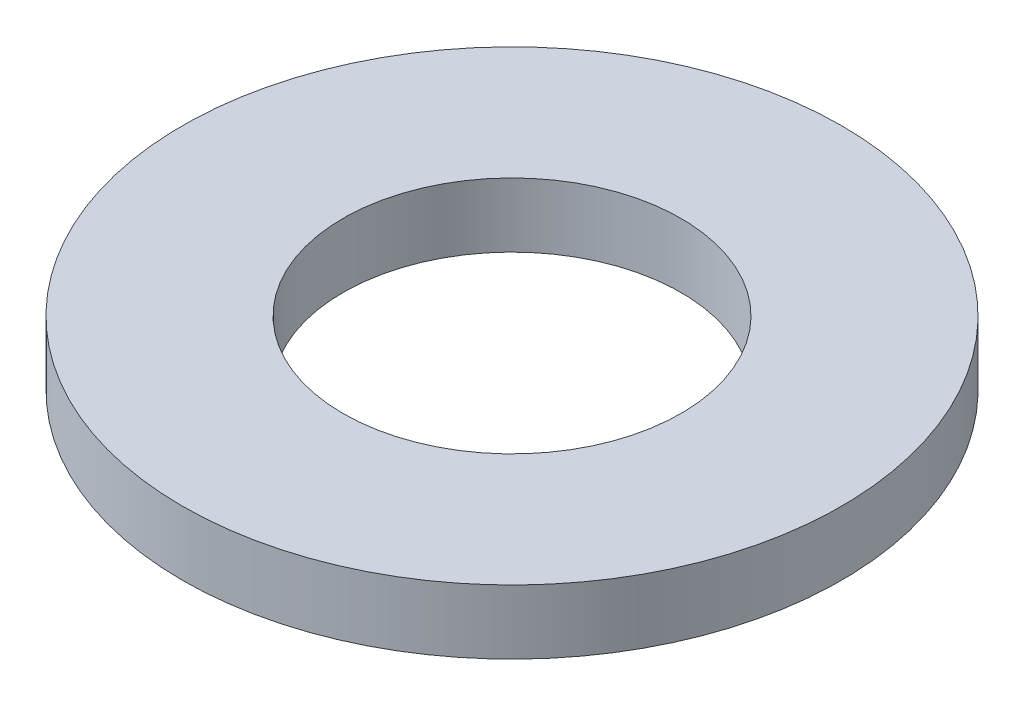
ISO-10303-21;
HEADER;
FILE_DESCRIPTION(('STEP AP214'),'2;1');
FILE_NAME('part.step','',(''),(''),'','','');
FILE_SCHEMA(('AUTOMOTIVE_DESIGN { 1 0 10303 214 1 1 1 1 }'));
ENDSEC;
DATA;
#1=APPLICATION_CONTEXT('core data for automotive mechanical design processes');
#2=APPLICATION_PROTOCOL_DEFINITION('international standard','automotive_design',2000,#1);
#3=PRODUCT_CONTEXT('',#1,'mechanical');
#4=PRODUCT('Part','Part','',(#3));
#5=PRODUCT_RELATED_PRODUCT_CATEGORY('part','',(#4));
#6=PRODUCT_DEFINITION_FORMATION('','',#4);
#7=PRODUCT_DEFINITION_CONTEXT('part definition',#1,'design');
#8=PRODUCT_DEFINITION('design','',#6,#7);
#9=PRODUCT_DEFINITION_SHAPE('','',#8);
#10=(LENGTH_UNIT() NAMED_UNIT(*) SI_UNIT(.MILLI.,.METRE.));
#11=(NAMED_UNIT(*) PLANE_ANGLE_UNIT() SI_UNIT($,.RADIAN.));
#12=(NAMED_UNIT(*) SI_UNIT($,.STERADIAN.) SOLID_ANGLE_UNIT());
#13=UNCERTAINTY_MEASURE_WITH_UNIT(LENGTH_MEASURE(1.E-05),#10,'distance_accuracy_value','');
#14=(GEOMETRIC_REPRESENTATION_CONTEXT(3) GLOBAL_UNCERTAINTY_ASSIGNED_CONTEXT((#13)) GLOBAL_UNIT_ASSIGNED_CONTEXT((#10,
#11,#12)) REPRESENTATION_CONTEXT('',''));
#15=CARTESIAN_POINT('',(0.,0.,0.));
#16=DIRECTION('',(0.,0.,1.));
#17=DIRECTION('',(1.,0.,0.));
#18=AXIS2_PLACEMENT_3D('',#15,#16,#17);
#19=CARTESIAN_POINT('',(0.,19.,0.));
#20=DIRECTION('',(0.,-1.,0.));
#21=DIRECTION('',(0.,0.,-1.));
#22=AXIS2_PLACEMENT_3D('',#19,#20,#21);
#23=CYLINDRICAL_SURFACE('',#22,97.5);
#24=CARTESIAN_POINT('',(0.,19.,0.));
#25=DIRECTION('',(0.,1.,0.));
#26=DIRECTION('',(0.,0.,1.));
#27=AXIS2_PLACEMENT_3D('',#24,#25,#26);
#28=CIRCLE('',#27,97.5);
#29=CARTESIAN_POINT('',(0.,19.,97.5));
#30=VERTEX_POINT('',#29);
#31=EDGE_CURVE('E10',#30,#30,#28,.T.);
#32=ORIENTED_EDGE('',*,*,#31,.F.);
#33=EDGE_LOOP('',(#32));
#34=FACE_BOUND('',#33,.T.);
#35=CARTESIAN_POINT('',(0.,0.,0.));
#36=DIRECTION('',(0.,1.,0.));
#37=DIRECTION('',(0.,0.,1.));
#38=AXIS2_PLACEMENT_3D('',#35,#36,#37);
#39=CIRCLE('',#38,97.5);
#40=CARTESIAN_POINT('',(0.,0.,97.5));
#41=VERTEX_POINT('',#40);
#42=EDGE_CURVE('E37',#41,#41,#39,.T.);
#43=ORIENTED_EDGE('',*,*,#42,.T.);
#44=EDGE_LOOP('',(#43));
#45=FACE_BOUND('',#44,.T.);
#46=ADVANCED_FACE('F40',(#34,#45),#23,.T.);
#47=CARTESIAN_POINT('',(0.,19.,0.));
#48=DIRECTION('',(0.,1.,0.));
#49=DIRECTION('',(0.,0.,1.));
#50=AXIS2_PLACEMENT_3D('',#47,#48,#49);
#51=PLANE('',#50);
#52=CARTESIAN_POINT('',(0.,19.,0.));
#53=DIRECTION('',(0.,1.,0.));
#54=DIRECTION('',(0.,0.,1.));
#55=AXIS2_PLACEMENT_3D('',#52,#53,#54);
#56=CIRCLE('',#55,50.);
#57=CARTESIAN_POINT('',(0.,19.,50.));
#58=VERTEX_POINT('',#57);
#59=EDGE_CURVE('E50',#58,#58,#56,.T.);
#60=ORIENTED_EDGE('',*,*,#59,.F.);
#61=EDGE_LOOP('',(#60));
#62=FACE_BOUND('',#61,.T.);
#63=ORIENTED_EDGE('',*,*,#31,.T.);
#64=EDGE_LOOP('',(#63));
#65=FACE_BOUND('',#64,.T.);
#66=ADVANCED_FACE('F59',(#62,#65),#51,.T.);
#67=CARTESIAN_POINT('',(0.,0.,0.));
#68=DIRECTION('',(0.,1.,0.));
#69=DIRECTION('',(0.,0.,1.));
#70=AXIS2_PLACEMENT_3D('',#67,#68,#69);
#71=PLANE('',#70);
#72=CARTESIAN_POINT('',(0.,0.,0.));
#73=DIRECTION('',(0.,1.,0.));
#74=DIRECTION('',(0.,0.,1.));
#75=AXIS2_PLACEMENT_3D('',#72,#73,#74);
#76=CIRCLE('',#75,50.);
#77=CARTESIAN_POINT('',(0.,0.,50.));
#78=VERTEX_POINT('',#77);
#79=EDGE_CURVE('E47',#78,#78,#76,.T.);
#80=ORIENTED_EDGE('',*,*,#79,.T.);
#81=EDGE_LOOP('',(#80));
#82=FACE_BOUND('',#81,.T.);
#83=ORIENTED_EDGE('',*,*,#42,.F.);
#84=EDGE_LOOP('',(#83));
#85=FACE_BOUND('',#84,.T.);
#86=ADVANCED_FACE('F58',(#82,#85),#71,.F.);
#87=CARTESIAN_POINT('',(0.,19.,0.));
#88=DIRECTION('',(0.,-1.,0.));
#89=DIRECTION('',(0.,0.,-1.));
#90=AXIS2_PLACEMENT_3D('',#87,#88,#89);
#91=CYLINDRICAL_SURFACE('',#90,50.);
#92=ORIENTED_EDGE('',*,*,#59,.T.);
#93=EDGE_LOOP('',(#92));
#94=FACE_BOUND('',#93,.T.);
#95=ORIENTED_EDGE('',*,*,#79,.F.);
#96=EDGE_LOOP('',(#95));
#97=FACE_BOUND('',#96,.T.);
#98=ADVANCED_FACE('F54',(#94,#97),#91,.F.);
#99=CLOSED_SHELL('',(#46,#66,#86,#98));
#100=MANIFOLD_SOLID_BREP('B2',#99);
#101=ADVANCED_BREP_SHAPE_REPRESENTATION('',(#18,#100),#14);
#102=SHAPE_DEFINITION_REPRESENTATION(#9,#101);
ENDSEC;
END-ISO-10303-21;
